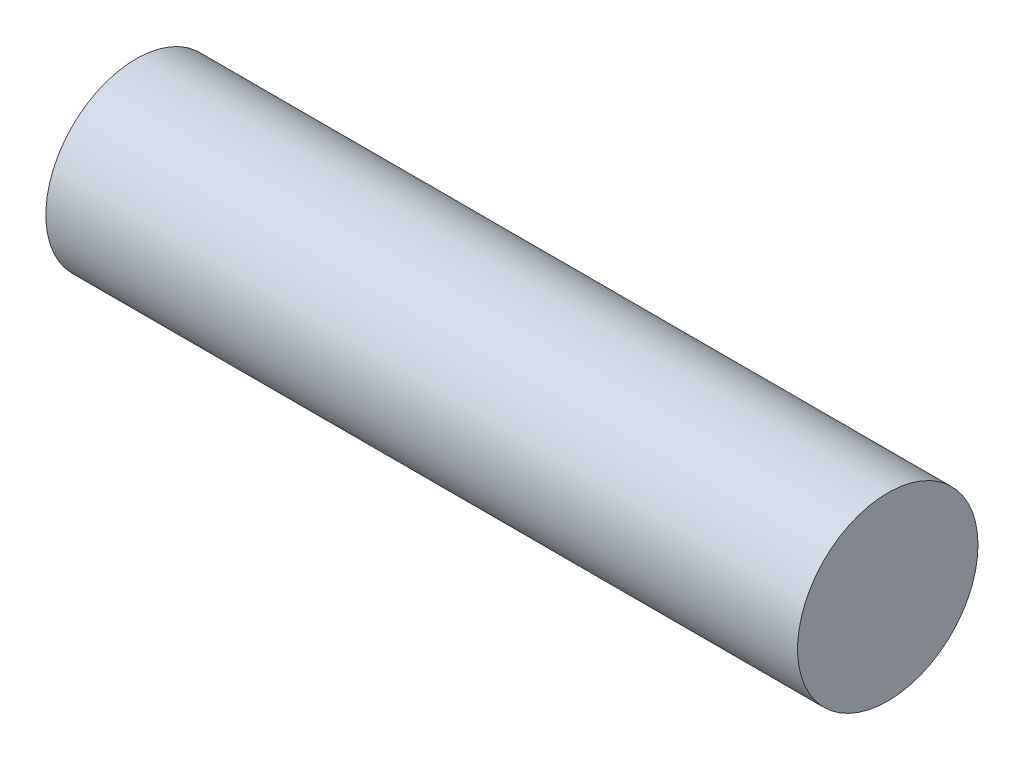
ISO-10303-21;
HEADER;
FILE_DESCRIPTION(('STEP AP214'),'2;1');
FILE_NAME('part.step','',(''),(''),'','','');
FILE_SCHEMA(('AUTOMOTIVE_DESIGN { 1 0 10303 214 1 1 1 1 }'));
ENDSEC;
DATA;
#1=APPLICATION_CONTEXT('core data for automotive mechanical design processes');
#2=APPLICATION_PROTOCOL_DEFINITION('international standard','automotive_design',2000,#1);
#3=PRODUCT_CONTEXT('',#1,'mechanical');
#4=PRODUCT('Part','Part','',(#3));
#5=PRODUCT_RELATED_PRODUCT_CATEGORY('part','',(#4));
#6=PRODUCT_DEFINITION_FORMATION('','',#4);
#7=PRODUCT_DEFINITION_CONTEXT('part definition',#1,'design');
#8=PRODUCT_DEFINITION('design','',#6,#7);
#9=PRODUCT_DEFINITION_SHAPE('','',#8);
#10=(LENGTH_UNIT() NAMED_UNIT(*) SI_UNIT(.MILLI.,.METRE.));
#11=(NAMED_UNIT(*) PLANE_ANGLE_UNIT() SI_UNIT($,.RADIAN.));
#12=(NAMED_UNIT(*) SI_UNIT($,.STERADIAN.) SOLID_ANGLE_UNIT());
#13=UNCERTAINTY_MEASURE_WITH_UNIT(LENGTH_MEASURE(1.E-05),#10,'distance_accuracy_value','');
#14=(GEOMETRIC_REPRESENTATION_CONTEXT(3) GLOBAL_UNCERTAINTY_ASSIGNED_CONTEXT((#13)) GLOBAL_UNIT_ASSIGNED_CONTEXT((#10,
#11,#12)) REPRESENTATION_CONTEXT('',''));
#15=CARTESIAN_POINT('',(0.,0.,0.));
#16=DIRECTION('',(0.,0.,1.));
#17=DIRECTION('',(1.,0.,0.));
#18=AXIS2_PLACEMENT_3D('',#15,#16,#17);
#19=CARTESIAN_POINT('',(25.,0.,0.));
#20=DIRECTION('',(-1.,0.,0.));
#21=DIRECTION('',(0.,0.,1.));
#22=AXIS2_PLACEMENT_3D('',#19,#20,#21);
#23=CYLINDRICAL_SURFACE('',#22,3.);
#24=CARTESIAN_POINT('',(25.,0.,0.));
#25=DIRECTION('',(1.,0.,0.));
#26=DIRECTION('',(0.,0.,-1.));
#27=AXIS2_PLACEMENT_3D('',#24,#25,#26);
#28=CIRCLE('',#27,3.);
#29=CARTESIAN_POINT('',(25.,0.,-3.));
#30=VERTEX_POINT('',#29);
#31=EDGE_CURVE('E10',#30,#30,#28,.T.);
#32=ORIENTED_EDGE('',*,*,#31,.F.);
#33=EDGE_LOOP('',(#32));
#34=FACE_BOUND('',#33,.T.);
#35=CARTESIAN_POINT('',(0.,0.,0.));
#36=DIRECTION('',(1.,0.,0.));
#37=DIRECTION('',(0.,0.,-1.));
#38=AXIS2_PLACEMENT_3D('',#35,#36,#37);
#39=CIRCLE('',#38,3.);
#40=CARTESIAN_POINT('',(0.,0.,-3.));
#41=VERTEX_POINT('',#40);
#42=EDGE_CURVE('E35',#41,#41,#39,.T.);
#43=ORIENTED_EDGE('',*,*,#42,.T.);
#44=EDGE_LOOP('',(#43));
#45=FACE_BOUND('',#44,.T.);
#46=ADVANCED_FACE('F32',(#34,#45),#23,.T.);
#47=CARTESIAN_POINT('',(25.,0.,0.));
#48=DIRECTION('',(1.,0.,0.));
#49=DIRECTION('',(0.,0.,-1.));
#50=AXIS2_PLACEMENT_3D('',#47,#48,#49);
#51=PLANE('',#50);
#52=ORIENTED_EDGE('',*,*,#31,.T.);
#53=EDGE_LOOP('',(#52));
#54=FACE_BOUND('',#53,.T.);
#55=ADVANCED_FACE('F47',(#54),#51,.T.);
#56=CARTESIAN_POINT('',(0.,0.,0.));
#57=DIRECTION('',(1.,0.,0.));
#58=DIRECTION('',(0.,0.,-1.));
#59=AXIS2_PLACEMENT_3D('',#56,#57,#58);
#60=PLANE('',#59);
#61=ORIENTED_EDGE('',*,*,#42,.F.);
#62=EDGE_LOOP('',(#61));
#63=FACE_BOUND('',#62,.T.);
#64=ADVANCED_FACE('F45',(#63),#60,.F.);
#65=CLOSED_SHELL('',(#46,#55,#64));
#66=MANIFOLD_SOLID_BREP('B2',#65);
#67=ADVANCED_BREP_SHAPE_REPRESENTATION('',(#18,#66),#14);
#68=SHAPE_DEFINITION_REPRESENTATION(#9,#67);
ENDSEC;
END-ISO-10303-21;
